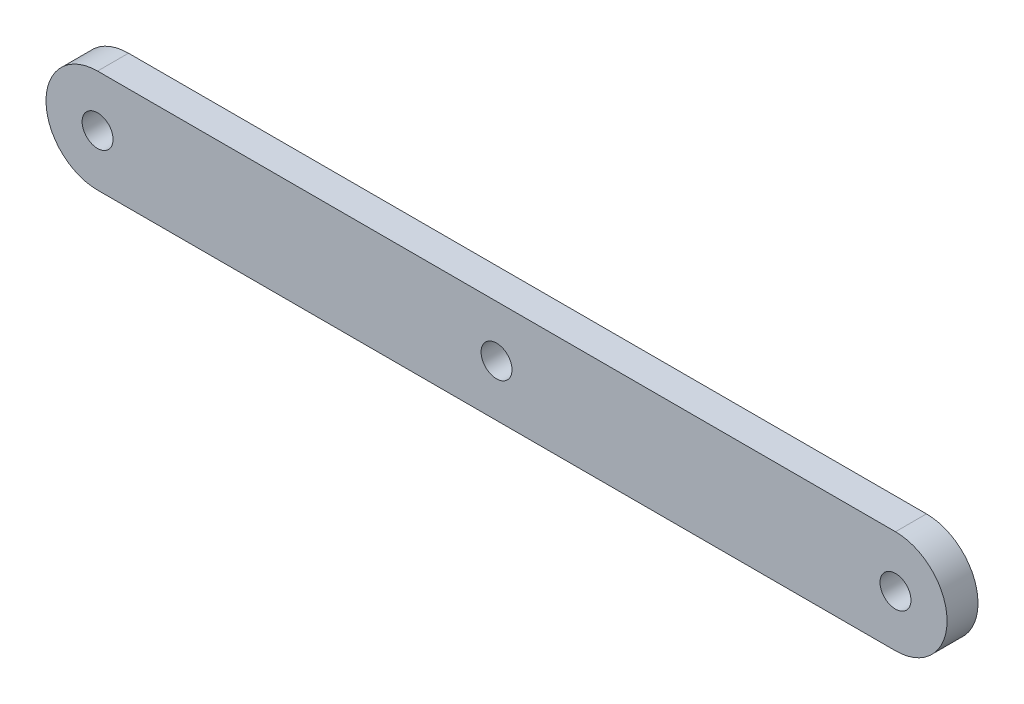
ISO-10303-21;
HEADER;
FILE_DESCRIPTION(('STEP AP214'),'2;1');
FILE_NAME('part.step','',(''),(''),'','','');
FILE_SCHEMA(('AUTOMOTIVE_DESIGN { 1 0 10303 214 1 1 1 1 }'));
ENDSEC;
DATA;
#1=APPLICATION_CONTEXT('core data for automotive mechanical design processes');
#2=APPLICATION_PROTOCOL_DEFINITION('international standard','automotive_design',2000,#1);
#3=PRODUCT_CONTEXT('',#1,'mechanical');
#4=PRODUCT('Part','Part','',(#3));
#5=PRODUCT_RELATED_PRODUCT_CATEGORY('part','',(#4));
#6=PRODUCT_DEFINITION_FORMATION('','',#4);
#7=PRODUCT_DEFINITION_CONTEXT('part definition',#1,'design');
#8=PRODUCT_DEFINITION('design','',#6,#7);
#9=PRODUCT_DEFINITION_SHAPE('','',#8);
#10=(LENGTH_UNIT() NAMED_UNIT(*) SI_UNIT(.MILLI.,.METRE.));
#11=(NAMED_UNIT(*) PLANE_ANGLE_UNIT() SI_UNIT($,.RADIAN.));
#12=(NAMED_UNIT(*) SI_UNIT($,.STERADIAN.) SOLID_ANGLE_UNIT());
#13=UNCERTAINTY_MEASURE_WITH_UNIT(LENGTH_MEASURE(1.E-05),#10,'distance_accuracy_value','');
#14=(GEOMETRIC_REPRESENTATION_CONTEXT(3) GLOBAL_UNCERTAINTY_ASSIGNED_CONTEXT((#13)) GLOBAL_UNIT_ASSIGNED_CONTEXT((#10,
#11,#12)) REPRESENTATION_CONTEXT('',''));
#15=CARTESIAN_POINT('',(0.,0.,0.));
#16=DIRECTION('',(0.,0.,1.));
#17=DIRECTION('',(1.,0.,0.));
#18=AXIS2_PLACEMENT_3D('',#15,#16,#17);
#19=CARTESIAN_POINT('',(-19.3421,0.,0.75));
#20=DIRECTION('',(0.,0.,1.));
#21=DIRECTION('',(1.,0.,0.));
#22=AXIS2_PLACEMENT_3D('',#19,#20,#21);
#23=PLANE('',#22);
#24=CARTESIAN_POINT('',(19.3421,0.,0.75));
#25=DIRECTION('',(0.,0.,1.));
#26=DIRECTION('',(1.,0.,0.));
#27=AXIS2_PLACEMENT_3D('',#24,#25,#26);
#28=CIRCLE('',#27,0.750000000000002);
#29=CARTESIAN_POINT('',(20.0921,0.,0.75));
#30=VERTEX_POINT('',#29);
#31=EDGE_CURVE('E115',#30,#30,#28,.T.);
#32=ORIENTED_EDGE('',*,*,#31,.F.);
#33=EDGE_LOOP('',(#32));
#34=FACE_BOUND('',#33,.T.);
#35=CARTESIAN_POINT('',(-19.3421,0.,0.75));
#36=DIRECTION('',(0.,0.,1.));
#37=DIRECTION('',(1.,0.,0.));
#38=AXIS2_PLACEMENT_3D('',#35,#36,#37);
#39=CIRCLE('',#38,2.50000000000001);
#40=CARTESIAN_POINT('',(-19.3421,2.50000000000001,0.75));
#41=VERTEX_POINT('',#40);
#42=CARTESIAN_POINT('',(-19.3421,-2.50000000000001,0.75));
#43=VERTEX_POINT('',#42);
#44=EDGE_CURVE('E85',#41,#43,#39,.T.);
#45=ORIENTED_EDGE('',*,*,#44,.T.);
#46=DIRECTION('',(1.,0.,0.));
#47=VECTOR('',#46,1.);
#48=CARTESIAN_POINT('',(-19.3421,-2.50000000000001,0.75));
#49=LINE('',#48,#47);
#50=CARTESIAN_POINT('',(19.3421,-2.5,0.75));
#51=VERTEX_POINT('',#50);
#52=EDGE_CURVE('E80',#43,#51,#49,.T.);
#53=ORIENTED_EDGE('',*,*,#52,.T.);
#54=CARTESIAN_POINT('',(19.3421,0.,0.75));
#55=DIRECTION('',(0.,0.,1.));
#56=DIRECTION('',(1.,0.,0.));
#57=AXIS2_PLACEMENT_3D('',#54,#55,#56);
#58=CIRCLE('',#57,2.50000000000001);
#59=CARTESIAN_POINT('',(19.3421,2.50000000000001,0.75));
#60=VERTEX_POINT('',#59);
#61=EDGE_CURVE('E83',#51,#60,#58,.T.);
#62=ORIENTED_EDGE('',*,*,#61,.T.);
#63=DIRECTION('',(-1.,0.,0.));
#64=VECTOR('',#63,1.);
#65=CARTESIAN_POINT('',(-19.3421,2.50000000000001,0.75));
#66=LINE('',#65,#64);
#67=EDGE_CURVE('E50',#60,#41,#66,.T.);
#68=ORIENTED_EDGE('',*,*,#67,.T.);
#69=EDGE_LOOP('',(#45,#53,#62,#68));
#70=FACE_BOUND('',#69,.T.);
#71=CARTESIAN_POINT('',(-19.3421,0.,0.75));
#72=DIRECTION('',(0.,0.,1.));
#73=DIRECTION('',(1.,0.,0.));
#74=AXIS2_PLACEMENT_3D('',#71,#72,#73);
#75=CIRCLE('',#74,0.750000000000002);
#76=CARTESIAN_POINT('',(-18.5921,0.,0.75));
#77=VERTEX_POINT('',#76);
#78=EDGE_CURVE('E100',#77,#77,#75,.T.);
#79=ORIENTED_EDGE('',*,*,#78,.F.);
#80=EDGE_LOOP('',(#79));
#81=FACE_BOUND('',#80,.T.);
#82=CARTESIAN_POINT('',(0.,0.,0.75));
#83=DIRECTION('',(0.,0.,1.));
#84=DIRECTION('',(1.,0.,0.));
#85=AXIS2_PLACEMENT_3D('',#82,#83,#84);
#86=CIRCLE('',#85,0.75);
#87=CARTESIAN_POINT('',(0.75,0.,0.75));
#88=VERTEX_POINT('',#87);
#89=EDGE_CURVE('E121',#88,#88,#86,.T.);
#90=ORIENTED_EDGE('',*,*,#89,.F.);
#91=EDGE_LOOP('',(#90));
#92=FACE_BOUND('',#91,.T.);
#93=ADVANCED_FACE('F33',(#34,#70,#81,#92),#23,.T.);
#94=CARTESIAN_POINT('',(-19.3421,0.,-0.75));
#95=DIRECTION('',(0.,0.,1.));
#96=DIRECTION('',(1.,0.,0.));
#97=AXIS2_PLACEMENT_3D('',#94,#95,#96);
#98=PLANE('',#97);
#99=CARTESIAN_POINT('',(-19.3421,0.,-0.75));
#100=DIRECTION('',(0.,0.,1.));
#101=DIRECTION('',(1.,0.,0.));
#102=AXIS2_PLACEMENT_3D('',#99,#100,#101);
#103=CIRCLE('',#102,2.50000000000001);
#104=CARTESIAN_POINT('',(-19.3421,2.50000000000001,-0.75));
#105=VERTEX_POINT('',#104);
#106=CARTESIAN_POINT('',(-19.3421,-2.50000000000001,-0.75));
#107=VERTEX_POINT('',#106);
#108=EDGE_CURVE('E97',#105,#107,#103,.T.);
#109=ORIENTED_EDGE('',*,*,#108,.F.);
#110=DIRECTION('',(-1.,0.,0.));
#111=VECTOR('',#110,1.);
#112=CARTESIAN_POINT('',(-19.3421,2.50000000000001,-0.75));
#113=LINE('',#112,#111);
#114=CARTESIAN_POINT('',(19.3421,2.50000000000001,-0.75));
#115=VERTEX_POINT('',#114);
#116=EDGE_CURVE('E73',#115,#105,#113,.T.);
#117=ORIENTED_EDGE('',*,*,#116,.F.);
#118=CARTESIAN_POINT('',(19.3421,0.,-0.75));
#119=DIRECTION('',(0.,0.,1.));
#120=DIRECTION('',(1.,0.,0.));
#121=AXIS2_PLACEMENT_3D('',#118,#119,#120);
#122=CIRCLE('',#121,2.50000000000001);
#123=CARTESIAN_POINT('',(19.3421,-2.5,-0.75));
#124=VERTEX_POINT('',#123);
#125=EDGE_CURVE('E67',#124,#115,#122,.T.);
#126=ORIENTED_EDGE('',*,*,#125,.F.);
#127=DIRECTION('',(1.,0.,0.));
#128=VECTOR('',#127,1.);
#129=CARTESIAN_POINT('',(-19.3421,-2.50000000000001,-0.75));
#130=LINE('',#129,#128);
#131=EDGE_CURVE('E89',#107,#124,#130,.T.);
#132=ORIENTED_EDGE('',*,*,#131,.F.);
#133=EDGE_LOOP('',(#109,#117,#126,#132));
#134=FACE_BOUND('',#133,.T.);
#135=CARTESIAN_POINT('',(-19.3421,0.,-0.75));
#136=DIRECTION('',(0.,0.,1.));
#137=DIRECTION('',(1.,0.,0.));
#138=AXIS2_PLACEMENT_3D('',#135,#136,#137);
#139=CIRCLE('',#138,0.750000000000002);
#140=CARTESIAN_POINT('',(-18.5921,0.,-0.75));
#141=VERTEX_POINT('',#140);
#142=EDGE_CURVE('E112',#141,#141,#139,.T.);
#143=ORIENTED_EDGE('',*,*,#142,.T.);
#144=EDGE_LOOP('',(#143));
#145=FACE_BOUND('',#144,.T.);
#146=CARTESIAN_POINT('',(19.3421,0.,-0.75));
#147=DIRECTION('',(0.,0.,1.));
#148=DIRECTION('',(1.,0.,0.));
#149=AXIS2_PLACEMENT_3D('',#146,#147,#148);
#150=CIRCLE('',#149,0.750000000000002);
#151=CARTESIAN_POINT('',(20.0921,0.,-0.75));
#152=VERTEX_POINT('',#151);
#153=EDGE_CURVE('E118',#152,#152,#150,.T.);
#154=ORIENTED_EDGE('',*,*,#153,.T.);
#155=EDGE_LOOP('',(#154));
#156=FACE_BOUND('',#155,.T.);
#157=CARTESIAN_POINT('',(0.,0.,-0.75));
#158=DIRECTION('',(0.,0.,1.));
#159=DIRECTION('',(1.,0.,0.));
#160=AXIS2_PLACEMENT_3D('',#157,#158,#159);
#161=CIRCLE('',#160,0.75);
#162=CARTESIAN_POINT('',(0.75,0.,-0.75));
#163=VERTEX_POINT('',#162);
#164=EDGE_CURVE('E124',#163,#163,#161,.T.);
#165=ORIENTED_EDGE('',*,*,#164,.T.);
#166=EDGE_LOOP('',(#165));
#167=FACE_BOUND('',#166,.T.);
#168=ADVANCED_FACE('F108',(#134,#145,#156,#167),#98,.F.);
#169=CARTESIAN_POINT('',(-19.3421,0.,0.75));
#170=DIRECTION('',(0.,0.,-1.));
#171=DIRECTION('',(-1.,0.,0.));
#172=AXIS2_PLACEMENT_3D('',#169,#170,#171);
#173=CYLINDRICAL_SURFACE('',#172,2.50000000000001);
#174=ORIENTED_EDGE('',*,*,#108,.T.);
#175=DIRECTION('',(0.,0.,-1.));
#176=VECTOR('',#175,1.);
#177=CARTESIAN_POINT('',(-19.3421,-2.50000000000001,0.75));
#178=LINE('',#177,#176);
#179=EDGE_CURVE('E11',#43,#107,#178,.T.);
#180=ORIENTED_EDGE('',*,*,#179,.F.);
#181=ORIENTED_EDGE('',*,*,#44,.F.);
#182=DIRECTION('',(0.,0.,-1.));
#183=VECTOR('',#182,1.);
#184=CARTESIAN_POINT('',(-19.3421,2.50000000000001,0.75));
#185=LINE('',#184,#183);
#186=EDGE_CURVE('E93',#41,#105,#185,.T.);
#187=ORIENTED_EDGE('',*,*,#186,.T.);
#188=EDGE_LOOP('',(#174,#180,#181,#187));
#189=FACE_BOUND('',#188,.T.);
#190=ADVANCED_FACE('F35',(#189),#173,.T.);
#191=CARTESIAN_POINT('',(-19.3421,-2.50000000000001,0.75));
#192=DIRECTION('',(0.,1.,0.));
#193=DIRECTION('',(-1.,0.,0.));
#194=AXIS2_PLACEMENT_3D('',#191,#192,#193);
#195=PLANE('',#194);
#196=ORIENTED_EDGE('',*,*,#131,.T.);
#197=DIRECTION('',(0.,0.,-1.));
#198=VECTOR('',#197,1.);
#199=CARTESIAN_POINT('',(19.3421,-2.5,0.75));
#200=LINE('',#199,#198);
#201=EDGE_CURVE('E42',#51,#124,#200,.T.);
#202=ORIENTED_EDGE('',*,*,#201,.F.);
#203=ORIENTED_EDGE('',*,*,#52,.F.);
#204=ORIENTED_EDGE('',*,*,#179,.T.);
#205=EDGE_LOOP('',(#196,#202,#203,#204));
#206=FACE_BOUND('',#205,.T.);
#207=ADVANCED_FACE('F88',(#206),#195,.F.);
#208=CARTESIAN_POINT('',(19.3421,0.,0.75));
#209=DIRECTION('',(0.,0.,-1.));
#210=DIRECTION('',(-1.,0.,0.));
#211=AXIS2_PLACEMENT_3D('',#208,#209,#210);
#212=CYLINDRICAL_SURFACE('',#211,2.50000000000001);
#213=ORIENTED_EDGE('',*,*,#125,.T.);
#214=DIRECTION('',(0.,0.,-1.));
#215=VECTOR('',#214,1.);
#216=CARTESIAN_POINT('',(19.3421,2.50000000000001,0.75));
#217=LINE('',#216,#215);
#218=EDGE_CURVE('E90',#60,#115,#217,.T.);
#219=ORIENTED_EDGE('',*,*,#218,.F.);
#220=ORIENTED_EDGE('',*,*,#61,.F.);
#221=ORIENTED_EDGE('',*,*,#201,.T.);
#222=EDGE_LOOP('',(#213,#219,#220,#221));
#223=FACE_BOUND('',#222,.T.);
#224=ADVANCED_FACE('F91',(#223),#212,.T.);
#225=CARTESIAN_POINT('',(-19.3421,2.50000000000001,0.75));
#226=DIRECTION('',(0.,-1.,0.));
#227=DIRECTION('',(1.,0.,0.));
#228=AXIS2_PLACEMENT_3D('',#225,#226,#227);
#229=PLANE('',#228);
#230=ORIENTED_EDGE('',*,*,#116,.T.);
#231=ORIENTED_EDGE('',*,*,#186,.F.);
#232=ORIENTED_EDGE('',*,*,#67,.F.);
#233=ORIENTED_EDGE('',*,*,#218,.T.);
#234=EDGE_LOOP('',(#230,#231,#232,#233));
#235=FACE_BOUND('',#234,.T.);
#236=ADVANCED_FACE('F105',(#235),#229,.F.);
#237=CARTESIAN_POINT('',(-19.3421,0.,0.75));
#238=DIRECTION('',(0.,0.,-1.));
#239=DIRECTION('',(-1.,0.,0.));
#240=AXIS2_PLACEMENT_3D('',#237,#238,#239);
#241=CYLINDRICAL_SURFACE('',#240,0.750000000000002);
#242=ORIENTED_EDGE('',*,*,#78,.T.);
#243=EDGE_LOOP('',(#242));
#244=FACE_BOUND('',#243,.T.);
#245=ORIENTED_EDGE('',*,*,#142,.F.);
#246=EDGE_LOOP('',(#245));
#247=FACE_BOUND('',#246,.T.);
#248=ADVANCED_FACE('F142',(#244,#247),#241,.F.);
#249=CARTESIAN_POINT('',(19.3421,0.,0.75));
#250=DIRECTION('',(0.,0.,-1.));
#251=DIRECTION('',(-1.,0.,0.));
#252=AXIS2_PLACEMENT_3D('',#249,#250,#251);
#253=CYLINDRICAL_SURFACE('',#252,0.750000000000002);
#254=ORIENTED_EDGE('',*,*,#31,.T.);
#255=EDGE_LOOP('',(#254));
#256=FACE_BOUND('',#255,.T.);
#257=ORIENTED_EDGE('',*,*,#153,.F.);
#258=EDGE_LOOP('',(#257));
#259=FACE_BOUND('',#258,.T.);
#260=ADVANCED_FACE('F188',(#256,#259),#253,.F.);
#261=CARTESIAN_POINT('',(0.,0.,0.75));
#262=DIRECTION('',(0.,0.,-1.));
#263=DIRECTION('',(-1.,0.,0.));
#264=AXIS2_PLACEMENT_3D('',#261,#262,#263);
#265=CYLINDRICAL_SURFACE('',#264,0.75);
#266=ORIENTED_EDGE('',*,*,#89,.T.);
#267=EDGE_LOOP('',(#266));
#268=FACE_BOUND('',#267,.T.);
#269=ORIENTED_EDGE('',*,*,#164,.F.);
#270=EDGE_LOOP('',(#269));
#271=FACE_BOUND('',#270,.T.);
#272=ADVANCED_FACE('F130',(#268,#271),#265,.F.);
#273=CLOSED_SHELL('',(#93,#168,#190,#207,#224,#236,#248,#260,#272));
#274=MANIFOLD_SOLID_BREP('B2',#273);
#275=ADVANCED_BREP_SHAPE_REPRESENTATION('',(#18,#274),#14);
#276=SHAPE_DEFINITION_REPRESENTATION(#9,#275);
ENDSEC;
END-ISO-10303-21;
